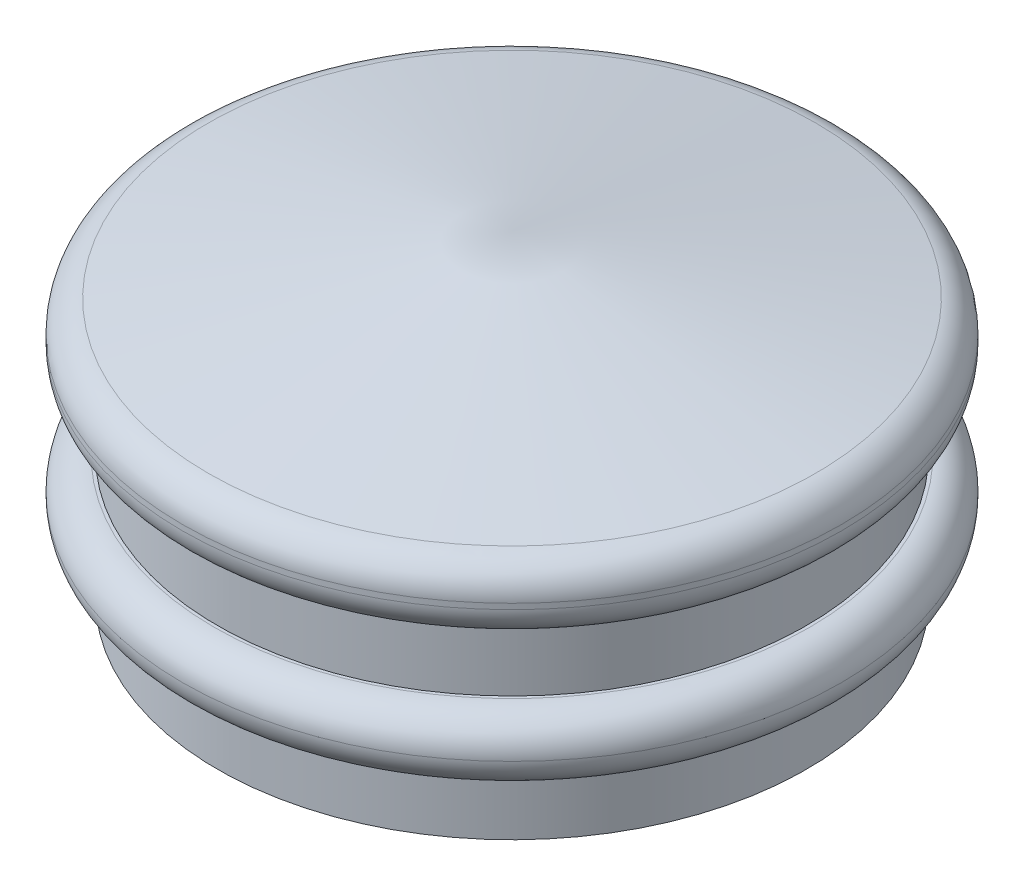
ISO-10303-21;
HEADER;
FILE_DESCRIPTION(('STEP AP214'),'2;1');
FILE_NAME('part.step','',(''),(''),'','','');
FILE_SCHEMA(('AUTOMOTIVE_DESIGN { 1 0 10303 214 1 1 1 1 }'));
ENDSEC;
DATA;
#1=APPLICATION_CONTEXT('core data for automotive mechanical design processes');
#2=APPLICATION_PROTOCOL_DEFINITION('international standard','automotive_design',2000,#1);
#3=PRODUCT_CONTEXT('',#1,'mechanical');
#4=PRODUCT('Part','Part','',(#3));
#5=PRODUCT_RELATED_PRODUCT_CATEGORY('part','',(#4));
#6=PRODUCT_DEFINITION_FORMATION('','',#4);
#7=PRODUCT_DEFINITION_CONTEXT('part definition',#1,'design');
#8=PRODUCT_DEFINITION('design','',#6,#7);
#9=PRODUCT_DEFINITION_SHAPE('','',#8);
#10=(LENGTH_UNIT() NAMED_UNIT(*) SI_UNIT(.MILLI.,.METRE.));
#11=(NAMED_UNIT(*) PLANE_ANGLE_UNIT() SI_UNIT($,.RADIAN.));
#12=(NAMED_UNIT(*) SI_UNIT($,.STERADIAN.) SOLID_ANGLE_UNIT());
#13=UNCERTAINTY_MEASURE_WITH_UNIT(LENGTH_MEASURE(1.E-05),#10,'distance_accuracy_value','');
#14=(GEOMETRIC_REPRESENTATION_CONTEXT(3) GLOBAL_UNCERTAINTY_ASSIGNED_CONTEXT((#13)) GLOBAL_UNIT_ASSIGNED_CONTEXT((#10,
#11,#12)) REPRESENTATION_CONTEXT('',''));
#15=CARTESIAN_POINT('',(0.,0.,0.));
#16=DIRECTION('',(0.,0.,1.));
#17=DIRECTION('',(1.,0.,0.));
#18=AXIS2_PLACEMENT_3D('',#15,#16,#17);
#19=CARTESIAN_POINT('',(-3.12671482255625,4.7,0.));
#20=DIRECTION('',(0.,1.,0.));
#21=DIRECTION('',(0.,0.,1.));
#22=AXIS2_PLACEMENT_3D('',#19,#20,#21);
#23=PLANE('',#22);
#24=CARTESIAN_POINT('',(0.,4.7,0.));
#25=DIRECTION('',(0.,-1.,0.));
#26=DIRECTION('',(0.,0.,-1.));
#27=AXIS2_PLACEMENT_3D('',#24,#25,#26);
#28=CIRCLE('',#27,3.12671482255625);
#29=CARTESIAN_POINT('',(0.,4.7,-3.12671482255625));
#30=VERTEX_POINT('',#29);
#31=EDGE_CURVE('E109',#30,#30,#28,.T.);
#32=ORIENTED_EDGE('',*,*,#31,.T.);
#33=EDGE_LOOP('',(#32));
#34=FACE_BOUND('',#33,.T.);
#35=ADVANCED_FACE('F32',(#34),#23,.F.);
#36=CARTESIAN_POINT('',(0.,0.,0.));
#37=DIRECTION('',(0.,-1.,0.));
#38=DIRECTION('',(0.,0.,-1.));
#39=AXIS2_PLACEMENT_3D('',#36,#37,#38);
#40=CYLINDRICAL_SURFACE('',#39,3.12671482255625);
#41=ORIENTED_EDGE('',*,*,#31,.F.);
#42=EDGE_LOOP('',(#41));
#43=FACE_BOUND('',#42,.T.);
#44=CARTESIAN_POINT('',(0.,1.42778782611235,0.));
#45=DIRECTION('',(0.,-1.,0.));
#46=DIRECTION('',(0.,0.,-1.));
#47=AXIS2_PLACEMENT_3D('',#44,#45,#46);
#48=CIRCLE('',#47,3.12671482255625);
#49=CARTESIAN_POINT('',(0.,1.42778782611235,-3.12671482255625));
#50=VERTEX_POINT('',#49);
#51=EDGE_CURVE('E106',#50,#50,#48,.T.);
#52=ORIENTED_EDGE('',*,*,#51,.T.);
#53=EDGE_LOOP('',(#52));
#54=FACE_BOUND('',#53,.T.);
#55=ADVANCED_FACE('F61',(#43,#54),#40,.F.);
#56=CARTESIAN_POINT('',(0.,0.,0.));
#57=DIRECTION('',(0.,-1.,0.));
#58=DIRECTION('',(0.,0.,-1.));
#59=AXIS2_PLACEMENT_3D('',#56,#57,#58);
#60=CONICAL_SURFACE('',#59,5.13625775539432,0.953055584701514);
#61=ORIENTED_EDGE('',*,*,#51,.F.);
#62=EDGE_LOOP('',(#61));
#63=FACE_BOUND('',#62,.T.);
#64=CARTESIAN_POINT('',(0.,0.,0.));
#65=DIRECTION('',(0.,-1.,0.));
#66=DIRECTION('',(0.,0.,-1.));
#67=AXIS2_PLACEMENT_3D('',#64,#65,#66);
#68=CIRCLE('',#67,5.13625775539432);
#69=CARTESIAN_POINT('',(0.,0.,-5.13625775539432));
#70=VERTEX_POINT('',#69);
#71=EDGE_CURVE('E103',#70,#70,#68,.T.);
#72=ORIENTED_EDGE('',*,*,#71,.T.);
#73=EDGE_LOOP('',(#72));
#74=FACE_BOUND('',#73,.T.);
#75=ADVANCED_FACE('F67',(#63,#74),#60,.F.);
#76=CARTESIAN_POINT('',(-6.92737210857608,0.,0.));
#77=DIRECTION('',(0.,1.,0.));
#78=DIRECTION('',(0.,0.,1.));
#79=AXIS2_PLACEMENT_3D('',#76,#77,#78);
#80=PLANE('',#79);
#81=ORIENTED_EDGE('',*,*,#71,.F.);
#82=EDGE_LOOP('',(#81));
#83=FACE_BOUND('',#82,.T.);
#84=CARTESIAN_POINT('',(0.,0.,0.));
#85=DIRECTION('',(0.,-1.,0.));
#86=DIRECTION('',(0.,0.,-1.));
#87=AXIS2_PLACEMENT_3D('',#84,#85,#86);
#88=CIRCLE('',#87,6.92737210857608);
#89=CARTESIAN_POINT('',(0.,0.,-6.92737210857608));
#90=VERTEX_POINT('',#89);
#91=EDGE_CURVE('E100',#90,#90,#88,.T.);
#92=ORIENTED_EDGE('',*,*,#91,.T.);
#93=EDGE_LOOP('',(#92));
#94=FACE_BOUND('',#93,.T.);
#95=ADVANCED_FACE('F145',(#83,#94),#80,.F.);
#96=CARTESIAN_POINT('',(0.,0.,0.));
#97=DIRECTION('',(0.,-1.,0.));
#98=DIRECTION('',(0.,0.,-1.));
#99=AXIS2_PLACEMENT_3D('',#96,#97,#98);
#100=CYLINDRICAL_SURFACE('',#99,6.92737210857608);
#101=ORIENTED_EDGE('',*,*,#91,.F.);
#102=EDGE_LOOP('',(#101));
#103=FACE_BOUND('',#102,.T.);
#104=CARTESIAN_POINT('',(0.,1.42778782611235,0.));
#105=DIRECTION('',(0.,-1.,0.));
#106=DIRECTION('',(0.,0.,-1.));
#107=AXIS2_PLACEMENT_3D('',#104,#105,#106);
#108=CIRCLE('',#107,6.92737210857608);
#109=CARTESIAN_POINT('',(0.,1.42778782611235,-6.92737210857608));
#110=VERTEX_POINT('',#109);
#111=EDGE_CURVE('E95',#110,#110,#108,.T.);
#112=ORIENTED_EDGE('',*,*,#111,.T.);
#113=EDGE_LOOP('',(#112));
#114=FACE_BOUND('',#113,.T.);
#115=ADVANCED_FACE('F141',(#103,#114),#100,.T.);
#116=CARTESIAN_POINT('',(-7.75,1.42778782611235,0.));
#117=DIRECTION('',(0.,1.,0.));
#118=DIRECTION('',(0.,0.,1.));
#119=AXIS2_PLACEMENT_3D('',#116,#117,#118);
#120=PLANE('',#119);
#121=CARTESIAN_POINT('',(0.,1.42778782611235,0.));
#122=DIRECTION('',(0.,1.,0.));
#123=DIRECTION('',(0.,0.,1.));
#124=AXIS2_PLACEMENT_3D('',#121,#122,#123);
#125=CIRCLE('',#124,7.);
#126=CARTESIAN_POINT('',(0.,1.42778782611235,7.));
#127=VERTEX_POINT('',#126);
#128=EDGE_CURVE('E11',#127,#127,#125,.F.);
#129=ORIENTED_EDGE('',*,*,#128,.T.);
#130=EDGE_LOOP('',(#129));
#131=FACE_BOUND('',#130,.T.);
#132=ORIENTED_EDGE('',*,*,#111,.F.);
#133=EDGE_LOOP('',(#132));
#134=FACE_BOUND('',#133,.T.);
#135=ADVANCED_FACE('F127',(#131,#134),#120,.F.);
#136=CARTESIAN_POINT('',(-6.92737210857608,2.92778782611235,0.));
#137=DIRECTION('',(0.,-1.,0.));
#138=DIRECTION('',(0.,0.,-1.));
#139=AXIS2_PLACEMENT_3D('',#136,#137,#138);
#140=PLANE('',#139);
#141=CARTESIAN_POINT('',(0.,2.92778782611235,0.));
#142=DIRECTION('',(0.,-1.,0.));
#143=DIRECTION('',(0.,0.,-1.));
#144=AXIS2_PLACEMENT_3D('',#141,#142,#143);
#145=CIRCLE('',#144,7.);
#146=CARTESIAN_POINT('',(0.,2.92778782611235,-7.));
#147=VERTEX_POINT('',#146);
#148=EDGE_CURVE('E40',#147,#147,#145,.F.);
#149=ORIENTED_EDGE('',*,*,#148,.T.);
#150=EDGE_LOOP('',(#149));
#151=FACE_BOUND('',#150,.T.);
#152=CARTESIAN_POINT('',(0.,2.92778782611235,0.));
#153=DIRECTION('',(0.,-1.,0.));
#154=DIRECTION('',(0.,0.,-1.));
#155=AXIS2_PLACEMENT_3D('',#152,#153,#154);
#156=CIRCLE('',#155,6.92737210857608);
#157=CARTESIAN_POINT('',(0.,2.92778782611235,-6.92737210857608));
#158=VERTEX_POINT('',#157);
#159=EDGE_CURVE('E90',#158,#158,#156,.T.);
#160=ORIENTED_EDGE('',*,*,#159,.T.);
#161=EDGE_LOOP('',(#160));
#162=FACE_BOUND('',#161,.T.);
#163=ADVANCED_FACE('F123',(#151,#162),#140,.F.);
#164=CARTESIAN_POINT('',(0.,0.,0.));
#165=DIRECTION('',(0.,-1.,0.));
#166=DIRECTION('',(0.,0.,-1.));
#167=AXIS2_PLACEMENT_3D('',#164,#165,#166);
#168=CYLINDRICAL_SURFACE('',#167,6.92737210857608);
#169=ORIENTED_EDGE('',*,*,#159,.F.);
#170=EDGE_LOOP('',(#169));
#171=FACE_BOUND('',#170,.T.);
#172=CARTESIAN_POINT('',(0.,4.51821429824485,0.));
#173=DIRECTION('',(0.,-1.,0.));
#174=DIRECTION('',(0.,0.,-1.));
#175=AXIS2_PLACEMENT_3D('',#172,#173,#174);
#176=CIRCLE('',#175,6.92737210857608);
#177=CARTESIAN_POINT('',(0.,4.51821429824485,-6.92737210857608));
#178=VERTEX_POINT('',#177);
#179=EDGE_CURVE('E88',#178,#178,#176,.T.);
#180=ORIENTED_EDGE('',*,*,#179,.T.);
#181=EDGE_LOOP('',(#180));
#182=FACE_BOUND('',#181,.T.);
#183=ADVANCED_FACE('F126',(#171,#182),#168,.T.);
#184=CARTESIAN_POINT('',(-7.75,4.51821429824485,0.));
#185=DIRECTION('',(0.,1.,0.));
#186=DIRECTION('',(0.,0.,1.));
#187=AXIS2_PLACEMENT_3D('',#184,#185,#186);
#188=PLANE('',#187);
#189=CARTESIAN_POINT('',(0.,4.51821429824485,0.));
#190=DIRECTION('',(0.,1.,0.));
#191=DIRECTION('',(0.,0.,1.));
#192=AXIS2_PLACEMENT_3D('',#189,#190,#191);
#193=CIRCLE('',#192,7.);
#194=CARTESIAN_POINT('',(0.,4.51821429824485,7.));
#195=VERTEX_POINT('',#194);
#196=EDGE_CURVE('E119',#195,#195,#193,.F.);
#197=ORIENTED_EDGE('',*,*,#196,.T.);
#198=EDGE_LOOP('',(#197));
#199=FACE_BOUND('',#198,.T.);
#200=ORIENTED_EDGE('',*,*,#179,.F.);
#201=EDGE_LOOP('',(#200));
#202=FACE_BOUND('',#201,.T.);
#203=ADVANCED_FACE('F56',(#199,#202),#188,.F.);
#204=CARTESIAN_POINT('',(0.,0.,0.));
#205=DIRECTION('',(0.,-1.,0.));
#206=DIRECTION('',(0.,0.,-1.));
#207=AXIS2_PLACEMENT_3D('',#204,#205,#206);
#208=CYLINDRICAL_SURFACE('',#207,7.75);
#209=CARTESIAN_POINT('',(0.,5.39802718709957,0.));
#210=DIRECTION('',(0.,1.,0.));
#211=DIRECTION('',(0.,0.,1.));
#212=AXIS2_PLACEMENT_3D('',#209,#210,#211);
#213=CIRCLE('',#212,7.75);
#214=CARTESIAN_POINT('',(0.,5.39802718709957,7.75));
#215=VERTEX_POINT('',#214);
#216=EDGE_CURVE('E114',#215,#215,#213,.F.);
#217=ORIENTED_EDGE('',*,*,#216,.T.);
#218=EDGE_LOOP('',(#217));
#219=FACE_BOUND('',#218,.T.);
#220=CARTESIAN_POINT('',(0.,5.26821429824485,0.));
#221=DIRECTION('',(0.,1.,0.));
#222=DIRECTION('',(0.,0.,1.));
#223=AXIS2_PLACEMENT_3D('',#220,#221,#222);
#224=CIRCLE('',#223,7.75);
#225=CARTESIAN_POINT('',(0.,5.26821429824485,7.75));
#226=VERTEX_POINT('',#225);
#227=EDGE_CURVE('E111',#226,#226,#224,.T.);
#228=ORIENTED_EDGE('',*,*,#227,.T.);
#229=EDGE_LOOP('',(#228));
#230=FACE_BOUND('',#229,.T.);
#231=ADVANCED_FACE('F46',(#219,#230),#208,.T.);
#232=CARTESIAN_POINT('',(0.,7.5,0.));
#233=DIRECTION('',(0.,-1.,0.));
#234=DIRECTION('',(0.,0.,-1.));
#235=AXIS2_PLACEMENT_3D('',#232,#233,#234);
#236=CONICAL_SURFACE('',#235,0.,1.38187822611332);
#237=CARTESIAN_POINT('',(0.,6.13468317709924,0.));
#238=DIRECTION('',(0.,1.,0.));
#239=DIRECTION('',(0.,0.,1.));
#240=AXIS2_PLACEMENT_3D('',#237,#238,#239);
#241=CIRCLE('',#240,7.14084726620565);
#242=CARTESIAN_POINT('',(0.,6.13468317709924,7.14084726620565));
#243=VERTEX_POINT('',#242);
#244=EDGE_CURVE('E117',#243,#243,#241,.T.);
#245=ORIENTED_EDGE('',*,*,#244,.T.);
#246=EDGE_LOOP('',(#245));
#247=FACE_BOUND('',#246,.T.);
#248=CARTESIAN_POINT('',(0.,7.5,0.));
#249=VERTEX_POINT('',#248);
#250=VERTEX_LOOP('',#249);
#251=FACE_BOUND('',#250,.T.);
#252=ADVANCED_FACE('F43',(#247,#251),#236,.T.);
#253=CARTESIAN_POINT('',(0.,5.39802718709957,0.));
#254=DIRECTION('',(0.,1.,0.));
#255=DIRECTION('',(0.,0.,1.));
#256=AXIS2_PLACEMENT_3D('',#253,#254,#255);
#257=TOROIDAL_SURFACE('',#256,7.,0.75);
#258=ORIENTED_EDGE('',*,*,#244,.F.);
#259=EDGE_LOOP('',(#258));
#260=FACE_BOUND('',#259,.T.);
#261=ORIENTED_EDGE('',*,*,#216,.F.);
#262=EDGE_LOOP('',(#261));
#263=FACE_BOUND('',#262,.T.);
#264=ADVANCED_FACE('F45',(#260,#263),#257,.T.);
#265=CARTESIAN_POINT('',(0.,5.26821429824485,0.));
#266=DIRECTION('',(0.,1.,0.));
#267=DIRECTION('',(0.,0.,1.));
#268=AXIS2_PLACEMENT_3D('',#265,#266,#267);
#269=TOROIDAL_SURFACE('',#268,7.,0.75);
#270=ORIENTED_EDGE('',*,*,#227,.F.);
#271=EDGE_LOOP('',(#270));
#272=FACE_BOUND('',#271,.T.);
#273=ORIENTED_EDGE('',*,*,#196,.F.);
#274=EDGE_LOOP('',(#273));
#275=FACE_BOUND('',#274,.T.);
#276=ADVANCED_FACE('F53',(#272,#275),#269,.T.);
#277=CARTESIAN_POINT('',(0.,2.17778782611235,0.));
#278=DIRECTION('',(0.,1.,0.));
#279=DIRECTION('',(0.,0.,1.));
#280=AXIS2_PLACEMENT_3D('',#277,#278,#279);
#281=TOROIDAL_SURFACE('',#280,7.,0.75);
#282=ORIENTED_EDGE('',*,*,#128,.F.);
#283=EDGE_LOOP('',(#282));
#284=FACE_BOUND('',#283,.T.);
#285=CARTESIAN_POINT('',(0.,2.17778782611235,0.));
#286=DIRECTION('',(0.,1.,0.));
#287=DIRECTION('',(0.,0.,1.));
#288=AXIS2_PLACEMENT_3D('',#285,#286,#287);
#289=CIRCLE('',#288,7.75);
#290=CARTESIAN_POINT('',(0.,2.17778782611235,7.75));
#291=VERTEX_POINT('',#290);
#292=EDGE_CURVE('E36',#291,#291,#289,.T.);
#293=ORIENTED_EDGE('',*,*,#292,.F.);
#294=EDGE_LOOP('',(#293));
#295=FACE_BOUND('',#294,.T.);
#296=ADVANCED_FACE('F34',(#284,#295),#281,.T.);
#297=CARTESIAN_POINT('',(0.,2.17778782611235,0.));
#298=DIRECTION('',(0.,-1.,0.));
#299=DIRECTION('',(0.,0.,-1.));
#300=AXIS2_PLACEMENT_3D('',#297,#298,#299);
#301=TOROIDAL_SURFACE('',#300,7.,0.75);
#302=ORIENTED_EDGE('',*,*,#148,.F.);
#303=EDGE_LOOP('',(#302));
#304=FACE_BOUND('',#303,.T.);
#305=ORIENTED_EDGE('',*,*,#292,.T.);
#306=EDGE_LOOP('',(#305));
#307=FACE_BOUND('',#306,.T.);
#308=ADVANCED_FACE('F75',(#304,#307),#301,.T.);
#309=CLOSED_SHELL('',(#35,#55,#75,#95,#115,#135,#163,#183,#203,#231,#252,#264,#276,#296,#308));
#310=MANIFOLD_SOLID_BREP('B2',#309);
#311=ADVANCED_BREP_SHAPE_REPRESENTATION('',(#18,#310),#14);
#312=SHAPE_DEFINITION_REPRESENTATION(#9,#311);
ENDSEC;
END-ISO-10303-21;
